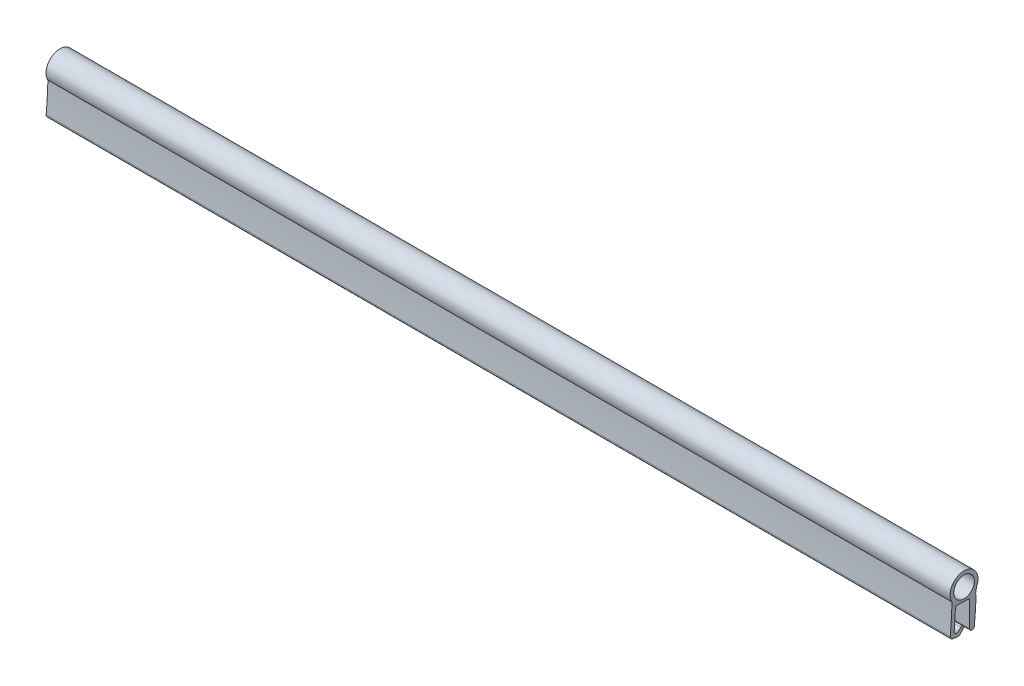
ISO-10303-21;
HEADER;
FILE_DESCRIPTION(('STEP AP214'),'2;1');
FILE_NAME('part.step','',(''),(''),'','','');
FILE_SCHEMA(('AUTOMOTIVE_DESIGN { 1 0 10303 214 1 1 1 1 }'));
ENDSEC;
DATA;
#1=APPLICATION_CONTEXT('core data for automotive mechanical design processes');
#2=APPLICATION_PROTOCOL_DEFINITION('international standard','automotive_design',2000,#1);
#3=PRODUCT_CONTEXT('',#1,'mechanical');
#4=PRODUCT('Part','Part','',(#3));
#5=PRODUCT_RELATED_PRODUCT_CATEGORY('part','',(#4));
#6=PRODUCT_DEFINITION_FORMATION('','',#4);
#7=PRODUCT_DEFINITION_CONTEXT('part definition',#1,'design');
#8=PRODUCT_DEFINITION('design','',#6,#7);
#9=PRODUCT_DEFINITION_SHAPE('','',#8);
#10=(LENGTH_UNIT() NAMED_UNIT(*) SI_UNIT(.MILLI.,.METRE.));
#11=(NAMED_UNIT(*) PLANE_ANGLE_UNIT() SI_UNIT($,.RADIAN.));
#12=(NAMED_UNIT(*) SI_UNIT($,.STERADIAN.) SOLID_ANGLE_UNIT());
#13=UNCERTAINTY_MEASURE_WITH_UNIT(LENGTH_MEASURE(1.E-05),#10,'distance_accuracy_value','');
#14=(GEOMETRIC_REPRESENTATION_CONTEXT(3) GLOBAL_UNCERTAINTY_ASSIGNED_CONTEXT((#13)) GLOBAL_UNIT_ASSIGNED_CONTEXT((#10,
#11,#12)) REPRESENTATION_CONTEXT('',''));
#15=CARTESIAN_POINT('',(0.,0.,0.));
#16=DIRECTION('',(0.,0.,1.));
#17=DIRECTION('',(1.,0.,0.));
#18=AXIS2_PLACEMENT_3D('',#15,#16,#17);
#19=CARTESIAN_POINT('',(149.,-0.650830109860595,2.03541757148668));
#20=DIRECTION('',(1.,0.,0.));
#21=DIRECTION('',(0.,0.,-1.));
#22=AXIS2_PLACEMENT_3D('',#19,#20,#21);
#23=PLANE('',#22);
#24=CARTESIAN_POINT('',(149.,-0.650830109860595,2.03541757148668));
#25=DIRECTION('',(1.,0.,0.));
#26=DIRECTION('',(0.,0.,-1.));
#27=AXIS2_PLACEMENT_3D('',#24,#25,#26);
#28=CIRCLE('',#27,2.30000000000009);
#29=CARTESIAN_POINT('',(149.,-1.75288906355364,0.0166392125314426));
#30=VERTEX_POINT('',#29);
#31=CARTESIAN_POINT('',(149.,-1.80815685312589,4.02302789781395));
#32=VERTEX_POINT('',#31);
#33=EDGE_CURVE('E248',#30,#32,#28,.T.);
#34=ORIENTED_EDGE('',*,*,#33,.T.);
#35=CARTESIAN_POINT('',(149.,0.,75.));
#36=DIRECTION('',(-1.,0.,0.));
#37=DIRECTION('',(0.,0.,-1.));
#38=AXIS2_PLACEMENT_3D('',#35,#36,#37);
#39=CIRCLE('',#38,71.);
#40=CARTESIAN_POINT('',(149.,-6.60581165375607,4.30796896116858));
#41=VERTEX_POINT('',#40);
#42=EDGE_CURVE('E131',#32,#41,#39,.T.);
#43=ORIENTED_EDGE('',*,*,#42,.T.);
#44=CARTESIAN_POINT('',(149.,-6.65233145413448,3.81013775666977));
#45=DIRECTION('',(1.,0.,0.));
#46=DIRECTION('',(0.,0.,-1.));
#47=AXIS2_PLACEMENT_3D('',#44,#45,#46);
#48=CIRCLE('',#47,0.500000000000065);
#49=CARTESIAN_POINT('',(149.,-7.14982517268786,3.86013775666976));
#50=VERTEX_POINT('',#49);
#51=EDGE_CURVE('E302',#41,#50,#48,.T.);
#52=ORIENTED_EDGE('',*,*,#51,.T.);
#53=DIRECTION('',(0.,-0.0999999999999999,-0.99498743710662));
#54=VECTOR('',#53,1.);
#55=CARTESIAN_POINT('',(149.,-7.14982517268794,3.86013775666977));
#56=LINE('',#55,#54);
#57=CARTESIAN_POINT('',(149.,-7.23653013578502,2.9974342665059));
#58=VERTEX_POINT('',#57);
#59=EDGE_CURVE('E321',#50,#58,#56,.T.);
#60=ORIENTED_EDGE('',*,*,#59,.T.);
#61=CARTESIAN_POINT('',(149.,-6.93803390465304,2.96743426650591));
#62=DIRECTION('',(1.,0.,0.));
#63=DIRECTION('',(0.,0.,1.));
#64=AXIS2_PLACEMENT_3D('',#61,#62,#63);
#65=CIRCLE('',#64,0.300000000000001);
#66=CARTESIAN_POINT('',(149.,-7.150165939009,2.75530223214994));
#67=VERTEX_POINT('',#66);
#68=EDGE_CURVE('E318',#58,#67,#65,.T.);
#69=ORIENTED_EDGE('',*,*,#68,.T.);
#70=DIRECTION('',(0.,0.707106781186551,-0.707106781186544));
#71=VECTOR('',#70,1.);
#72=CARTESIAN_POINT('',(149.,-6.56026190706562,2.16539820020656));
#73=LINE('',#72,#71);
#74=CARTESIAN_POINT('',(149.,-6.56026190706562,2.16539820020656));
#75=VERTEX_POINT('',#74);
#76=EDGE_CURVE('E320',#67,#75,#73,.T.);
#77=ORIENTED_EDGE('',*,*,#76,.T.);
#78=CARTESIAN_POINT('',(149.,-6.34812987270965,2.37753023456253));
#79=DIRECTION('',(1.,0.,0.));
#80=DIRECTION('',(0.,0.,-1.));
#81=AXIS2_PLACEMENT_3D('',#78,#79,#80);
#82=CIRCLE('',#81,0.3);
#83=CARTESIAN_POINT('',(149.,-6.13599783835369,2.58966226891849));
#84=VERTEX_POINT('',#83);
#85=EDGE_CURVE('E323',#75,#84,#82,.T.);
#86=ORIENTED_EDGE('',*,*,#85,.T.);
#87=DIRECTION('',(0.,-0.70710678118655,0.707106781186545));
#88=VECTOR('',#87,1.);
#89=CARTESIAN_POINT('',(149.,-6.13599783835369,2.58966226891849));
#90=LINE('',#89,#88);
#91=CARTESIAN_POINT('',(149.,-6.55825231483048,3.01191674539528));
#92=VERTEX_POINT('',#91);
#93=EDGE_CURVE('E329',#84,#92,#90,.T.);
#94=ORIENTED_EDGE('',*,*,#93,.T.);
#95=CARTESIAN_POINT('',(149.,-6.41683095859293,3.15333810163234));
#96=DIRECTION('',(-1.,0.,0.));
#97=DIRECTION('',(0.,0.,-1.));
#98=AXIS2_PLACEMENT_3D('',#95,#96,#97);
#99=CIRCLE('',#98,0.200000000000134);
#100=CARTESIAN_POINT('',(149.,-6.61582844601436,3.17333810163258));
#101=VERTEX_POINT('',#100);
#102=EDGE_CURVE('E331',#92,#101,#99,.T.);
#103=ORIENTED_EDGE('',*,*,#102,.T.);
#104=DIRECTION('',(0.,0.100000000000037,0.994987437106616));
#105=VECTOR('',#104,1.);
#106=CARTESIAN_POINT('',(149.,-6.59244423333353,3.40600808007444));
#107=LINE('',#106,#105);
#108=CARTESIAN_POINT('',(149.,-6.59244423333353,3.40600808007444));
#109=VERTEX_POINT('',#108);
#110=EDGE_CURVE('E333',#101,#109,#107,.T.);
#111=ORIENTED_EDGE('',*,*,#110,.T.);
#112=CARTESIAN_POINT('',(149.,-6.29394800220127,3.37600808007427));
#113=DIRECTION('',(-1.,0.,0.));
#114=DIRECTION('',(0.,0.,-1.));
#115=AXIS2_PLACEMENT_3D('',#112,#113,#114);
#116=CIRCLE('',#115,0.300000000000135);
#117=CARTESIAN_POINT('',(149.,-6.26768674489028,3.67485644691694));
#118=VERTEX_POINT('',#117);
#119=EDGE_CURVE('E335',#109,#118,#116,.T.);
#120=ORIENTED_EDGE('',*,*,#119,.T.);
#121=CARTESIAN_POINT('',(149.,0.,75.));
#122=DIRECTION('',(1.,0.,0.));
#123=DIRECTION('',(0.,0.,1.));
#124=AXIS2_PLACEMENT_3D('',#121,#122,#123);
#125=CIRCLE('',#124,71.6);
#126=CARTESIAN_POINT('',(149.,-2.97015351103039,3.46163135686617));
#127=VERTEX_POINT('',#126);
#128=EDGE_CURVE('E337',#118,#127,#125,.T.);
#129=ORIENTED_EDGE('',*,*,#128,.T.);
#130=CARTESIAN_POINT('',(149.,-2.98259828831126,3.16188958880835));
#131=DIRECTION('',(-1.,0.,0.));
#132=DIRECTION('',(0.,0.,1.));
#133=AXIS2_PLACEMENT_3D('',#130,#131,#132);
#134=CIRCLE('',#133,0.299999999999999);
#135=CARTESIAN_POINT('',(149.,-2.68277009359612,3.15173805425141));
#136=VERTEX_POINT('',#135);
#137=EDGE_CURVE('E339',#127,#136,#134,.T.);
#138=ORIENTED_EDGE('',*,*,#137,.T.);
#139=DIRECTION('',(0.,-0.0338384485231478,-0.999427315717129));
#140=VECTOR('',#139,1.);
#141=CARTESIAN_POINT('',(149.,-2.68277009359612,3.15173805425141));
#142=LINE('',#141,#140);
#143=CARTESIAN_POINT('',(149.,-2.74255173599329,1.38607180778347));
#144=VERTEX_POINT('',#143);
#145=EDGE_CURVE('E341',#136,#144,#142,.T.);
#146=ORIENTED_EDGE('',*,*,#145,.T.);
#147=CARTESIAN_POINT('',(149.,-3.04237993070843,1.39622334234042));
#148=DIRECTION('',(-1.,0.,0.));
#149=DIRECTION('',(0.,0.,1.));
#150=AXIS2_PLACEMENT_3D('',#147,#148,#149);
#151=CIRCLE('',#150,0.3);
#152=CARTESIAN_POINT('',(149.,-3.04237993070843,1.09622334234042));
#153=VERTEX_POINT('',#152);
#154=EDGE_CURVE('E343',#144,#153,#151,.T.);
#155=ORIENTED_EDGE('',*,*,#154,.T.);
#156=DIRECTION('',(0.,-1.,0.));
#157=VECTOR('',#156,1.);
#158=CARTESIAN_POINT('',(149.,-7.08425590173751,1.09622334234042));
#159=LINE('',#158,#157);
#160=CARTESIAN_POINT('',(149.,-7.08425590173751,1.09622334234042));
#161=VERTEX_POINT('',#160);
#162=EDGE_CURVE('E345',#153,#161,#159,.T.);
#163=ORIENTED_EDGE('',*,*,#162,.T.);
#164=CARTESIAN_POINT('',(149.,-7.08425590173751,0.716632184241867));
#165=DIRECTION('',(1.,0.,0.));
#166=DIRECTION('',(0.,0.,-1.));
#167=AXIS2_PLACEMENT_3D('',#164,#165,#166);
#168=CIRCLE('',#167,0.379591158098444);
#169=CARTESIAN_POINT('',(149.,-7.12029323982961,0.338755540917946));
#170=VERTEX_POINT('',#169);
#171=EDGE_CURVE('E347',#161,#170,#168,.T.);
#172=ORIENTED_EDGE('',*,*,#171,.T.);
#173=CARTESIAN_POINT('',(149.,0.,75.));
#174=DIRECTION('',(1.,0.,0.));
#175=DIRECTION('',(0.,0.,-1.));
#176=AXIS2_PLACEMENT_3D('',#173,#174,#175);
#177=CIRCLE('',#176,74.9999999999999);
#178=CARTESIAN_POINT('',(149.,-2.73749429668321,0.0499758173781173));
#179=VERTEX_POINT('',#178);
#180=EDGE_CURVE('E189',#170,#179,#177,.T.);
#181=ORIENTED_EDGE('',*,*,#180,.T.);
#182=DIRECTION('',(0.,0.730629228662196,0.682774435831106));
#183=VECTOR('',#182,1.);
#184=CARTESIAN_POINT('',(149.,-2.53111594953157,0.242836784358741));
#185=LINE('',#184,#183);
#186=CARTESIAN_POINT('',(149.,-2.53111594953157,0.242836784358741));
#187=VERTEX_POINT('',#186);
#188=EDGE_CURVE('E183',#179,#187,#185,.T.);
#189=ORIENTED_EDGE('',*,*,#188,.T.);
#190=DIRECTION('',(0.,0.68277443583108,-0.73062922866222));
#191=VECTOR('',#190,1.);
#192=CARTESIAN_POINT('',(149.,-2.3382549825508,0.036458437207107));
#193=LINE('',#192,#191);
#194=CARTESIAN_POINT('',(149.,-2.3382549825508,0.036458437207107));
#195=VERTEX_POINT('',#194);
#196=EDGE_CURVE('E187',#187,#195,#193,.T.);
#197=ORIENTED_EDGE('',*,*,#196,.T.);
#198=DIRECTION('',(0.,0.999427315717129,-0.0338384485231536));
#199=VECTOR('',#198,1.);
#200=CARTESIAN_POINT('',(149.,-2.3382549825508,0.036458437207107));
#201=LINE('',#200,#199);
#202=EDGE_CURVE('E49',#195,#30,#201,.T.);
#203=ORIENTED_EDGE('',*,*,#202,.T.);
#204=EDGE_LOOP('',(#34,#43,#52,#60,#69,#77,#86,#94,#103,#111,#120,#129,#138,#146,#155,#163,#172,
#181,#189,#197,#203));
#205=FACE_BOUND('',#204,.T.);
#206=CARTESIAN_POINT('',(149.,-0.650830109860595,2.03541757148668));
#207=DIRECTION('',(1.,0.,0.));
#208=DIRECTION('',(0.,0.,-1.));
#209=AXIS2_PLACEMENT_3D('',#206,#207,#208);
#210=CIRCLE('',#209,1.70000000000194);
#211=CARTESIAN_POINT('',(149.,-0.650830109860595,0.335417571484737));
#212=VERTEX_POINT('',#211);
#213=EDGE_CURVE('E211',#212,#212,#210,.T.);
#214=ORIENTED_EDGE('',*,*,#213,.F.);
#215=EDGE_LOOP('',(#214));
#216=FACE_BOUND('',#215,.T.);
#217=ADVANCED_FACE('F32',(#205,#216),#23,.T.);
#218=CARTESIAN_POINT('',(0.,-0.650830109860595,2.03541757148668));
#219=DIRECTION('',(1.,0.,0.));
#220=DIRECTION('',(0.,0.,-1.));
#221=AXIS2_PLACEMENT_3D('',#218,#219,#220);
#222=PLANE('',#221);
#223=CARTESIAN_POINT('',(0.,-0.650830109860595,2.03541757148668));
#224=DIRECTION('',(1.,0.,0.));
#225=DIRECTION('',(0.,0.,-1.));
#226=AXIS2_PLACEMENT_3D('',#223,#224,#225);
#227=CIRCLE('',#226,2.30000000000009);
#228=CARTESIAN_POINT('',(0.,-1.75288906355364,0.0166392125314426));
#229=VERTEX_POINT('',#228);
#230=CARTESIAN_POINT('',(0.,-1.80815685312589,4.02302789781395));
#231=VERTEX_POINT('',#230);
#232=EDGE_CURVE('E207',#229,#231,#227,.T.);
#233=ORIENTED_EDGE('',*,*,#232,.F.);
#234=DIRECTION('',(0.,0.999427315717129,-0.0338384485231536));
#235=VECTOR('',#234,1.);
#236=CARTESIAN_POINT('',(0.,-2.3382549825508,0.036458437207107));
#237=LINE('',#236,#235);
#238=CARTESIAN_POINT('',(0.,-2.3382549825508,0.036458437207107));
#239=VERTEX_POINT('',#238);
#240=EDGE_CURVE('E123',#239,#229,#237,.T.);
#241=ORIENTED_EDGE('',*,*,#240,.F.);
#242=DIRECTION('',(0.,0.68277443583108,-0.73062922866222));
#243=VECTOR('',#242,1.);
#244=CARTESIAN_POINT('',(0.,-2.3382549825508,0.036458437207107));
#245=LINE('',#244,#243);
#246=CARTESIAN_POINT('',(0.,-2.53111594953157,0.242836784358741));
#247=VERTEX_POINT('',#246);
#248=EDGE_CURVE('E117',#247,#239,#245,.T.);
#249=ORIENTED_EDGE('',*,*,#248,.F.);
#250=DIRECTION('',(0.,0.730629228662196,0.682774435831106));
#251=VECTOR('',#250,1.);
#252=CARTESIAN_POINT('',(0.,-2.53111594953157,0.242836784358741));
#253=LINE('',#252,#251);
#254=CARTESIAN_POINT('',(0.,-2.73749429668321,0.0499758173781173));
#255=VERTEX_POINT('',#254);
#256=EDGE_CURVE('E197',#255,#247,#253,.T.);
#257=ORIENTED_EDGE('',*,*,#256,.F.);
#258=CARTESIAN_POINT('',(0.,0.,75.));
#259=DIRECTION('',(1.,0.,0.));
#260=DIRECTION('',(0.,0.,-1.));
#261=AXIS2_PLACEMENT_3D('',#258,#259,#260);
#262=CIRCLE('',#261,74.9999999999999);
#263=CARTESIAN_POINT('',(0.,-7.12029323982961,0.338755540917946));
#264=VERTEX_POINT('',#263);
#265=EDGE_CURVE('E243',#264,#255,#262,.T.);
#266=ORIENTED_EDGE('',*,*,#265,.F.);
#267=CARTESIAN_POINT('',(0.,-7.08425590173751,0.716632184241867));
#268=DIRECTION('',(1.,0.,0.));
#269=DIRECTION('',(0.,0.,-1.));
#270=AXIS2_PLACEMENT_3D('',#267,#268,#269);
#271=CIRCLE('',#270,0.379591158098444);
#272=CARTESIAN_POINT('',(0.,-7.08425590173751,1.09622334234042));
#273=VERTEX_POINT('',#272);
#274=EDGE_CURVE('E241',#273,#264,#271,.T.);
#275=ORIENTED_EDGE('',*,*,#274,.F.);
#276=DIRECTION('',(0.,-1.,0.));
#277=VECTOR('',#276,1.);
#278=CARTESIAN_POINT('',(0.,-7.08425590173751,1.09622334234042));
#279=LINE('',#278,#277);
#280=CARTESIAN_POINT('',(0.,-3.04237993070843,1.09622334234042));
#281=VERTEX_POINT('',#280);
#282=EDGE_CURVE('E239',#281,#273,#279,.T.);
#283=ORIENTED_EDGE('',*,*,#282,.F.);
#284=CARTESIAN_POINT('',(0.,-3.04237993070843,1.39622334234042));
#285=DIRECTION('',(-1.,0.,0.));
#286=DIRECTION('',(0.,0.,1.));
#287=AXIS2_PLACEMENT_3D('',#284,#285,#286);
#288=CIRCLE('',#287,0.3);
#289=CARTESIAN_POINT('',(0.,-2.74255173599329,1.38607180778347));
#290=VERTEX_POINT('',#289);
#291=EDGE_CURVE('E237',#290,#281,#288,.T.);
#292=ORIENTED_EDGE('',*,*,#291,.F.);
#293=DIRECTION('',(0.,-0.0338384485231478,-0.999427315717129));
#294=VECTOR('',#293,1.);
#295=CARTESIAN_POINT('',(0.,-2.68277009359612,3.15173805425141));
#296=LINE('',#295,#294);
#297=CARTESIAN_POINT('',(0.,-2.68277009359612,3.15173805425141));
#298=VERTEX_POINT('',#297);
#299=EDGE_CURVE('E235',#298,#290,#296,.T.);
#300=ORIENTED_EDGE('',*,*,#299,.F.);
#301=CARTESIAN_POINT('',(0.,-2.98259828831126,3.16188958880835));
#302=DIRECTION('',(-1.,0.,0.));
#303=DIRECTION('',(0.,0.,1.));
#304=AXIS2_PLACEMENT_3D('',#301,#302,#303);
#305=CIRCLE('',#304,0.299999999999999);
#306=CARTESIAN_POINT('',(0.,-2.97015351103039,3.46163135686617));
#307=VERTEX_POINT('',#306);
#308=EDGE_CURVE('E233',#307,#298,#305,.T.);
#309=ORIENTED_EDGE('',*,*,#308,.F.);
#310=CARTESIAN_POINT('',(0.,0.,75.));
#311=DIRECTION('',(1.,0.,0.));
#312=DIRECTION('',(0.,0.,1.));
#313=AXIS2_PLACEMENT_3D('',#310,#311,#312);
#314=CIRCLE('',#313,71.6);
#315=CARTESIAN_POINT('',(0.,-6.26768674489028,3.67485644691694));
#316=VERTEX_POINT('',#315);
#317=EDGE_CURVE('E231',#316,#307,#314,.T.);
#318=ORIENTED_EDGE('',*,*,#317,.F.);
#319=CARTESIAN_POINT('',(0.,-6.29394800220127,3.37600808007427));
#320=DIRECTION('',(-1.,0.,0.));
#321=DIRECTION('',(0.,0.,-1.));
#322=AXIS2_PLACEMENT_3D('',#319,#320,#321);
#323=CIRCLE('',#322,0.300000000000135);
#324=CARTESIAN_POINT('',(0.,-6.59244423333353,3.40600808007444));
#325=VERTEX_POINT('',#324);
#326=EDGE_CURVE('E229',#325,#316,#323,.T.);
#327=ORIENTED_EDGE('',*,*,#326,.F.);
#328=DIRECTION('',(0.,0.100000000000037,0.994987437106616));
#329=VECTOR('',#328,1.);
#330=CARTESIAN_POINT('',(0.,-6.59244423333353,3.40600808007444));
#331=LINE('',#330,#329);
#332=CARTESIAN_POINT('',(0.,-6.61582844601436,3.17333810163258));
#333=VERTEX_POINT('',#332);
#334=EDGE_CURVE('E227',#333,#325,#331,.T.);
#335=ORIENTED_EDGE('',*,*,#334,.F.);
#336=CARTESIAN_POINT('',(0.,-6.41683095859293,3.15333810163234));
#337=DIRECTION('',(-1.,0.,0.));
#338=DIRECTION('',(0.,0.,-1.));
#339=AXIS2_PLACEMENT_3D('',#336,#337,#338);
#340=CIRCLE('',#339,0.200000000000134);
#341=CARTESIAN_POINT('',(0.,-6.55825231483048,3.01191674539528));
#342=VERTEX_POINT('',#341);
#343=EDGE_CURVE('E225',#342,#333,#340,.T.);
#344=ORIENTED_EDGE('',*,*,#343,.F.);
#345=DIRECTION('',(0.,-0.70710678118655,0.707106781186545));
#346=VECTOR('',#345,1.);
#347=CARTESIAN_POINT('',(0.,-6.13599783835369,2.58966226891849));
#348=LINE('',#347,#346);
#349=CARTESIAN_POINT('',(0.,-6.13599783835369,2.58966226891849));
#350=VERTEX_POINT('',#349);
#351=EDGE_CURVE('E223',#350,#342,#348,.T.);
#352=ORIENTED_EDGE('',*,*,#351,.F.);
#353=CARTESIAN_POINT('',(0.,-6.34812987270965,2.37753023456253));
#354=DIRECTION('',(1.,0.,0.));
#355=DIRECTION('',(0.,0.,-1.));
#356=AXIS2_PLACEMENT_3D('',#353,#354,#355);
#357=CIRCLE('',#356,0.3);
#358=CARTESIAN_POINT('',(0.,-6.56026190706562,2.16539820020656));
#359=VERTEX_POINT('',#358);
#360=EDGE_CURVE('E221',#359,#350,#357,.T.);
#361=ORIENTED_EDGE('',*,*,#360,.F.);
#362=DIRECTION('',(0.,0.707106781186551,-0.707106781186544));
#363=VECTOR('',#362,1.);
#364=CARTESIAN_POINT('',(0.,-6.56026190706562,2.16539820020656));
#365=LINE('',#364,#363);
#366=CARTESIAN_POINT('',(0.,-7.150165939009,2.75530223214994));
#367=VERTEX_POINT('',#366);
#368=EDGE_CURVE('E219',#367,#359,#365,.T.);
#369=ORIENTED_EDGE('',*,*,#368,.F.);
#370=CARTESIAN_POINT('',(0.,-6.93803390465304,2.96743426650591));
#371=DIRECTION('',(1.,0.,0.));
#372=DIRECTION('',(0.,0.,1.));
#373=AXIS2_PLACEMENT_3D('',#370,#371,#372);
#374=CIRCLE('',#373,0.300000000000001);
#375=CARTESIAN_POINT('',(0.,-7.23653013578502,2.9974342665059));
#376=VERTEX_POINT('',#375);
#377=EDGE_CURVE('E217',#376,#367,#374,.T.);
#378=ORIENTED_EDGE('',*,*,#377,.F.);
#379=DIRECTION('',(0.,-0.0999999999999999,-0.99498743710662));
#380=VECTOR('',#379,1.);
#381=CARTESIAN_POINT('',(0.,-7.14982517268794,3.86013775666977));
#382=LINE('',#381,#380);
#383=CARTESIAN_POINT('',(0.,-7.14982517268786,3.86013775666976));
#384=VERTEX_POINT('',#383);
#385=EDGE_CURVE('E215',#384,#376,#382,.T.);
#386=ORIENTED_EDGE('',*,*,#385,.F.);
#387=CARTESIAN_POINT('',(0.,-6.65233145413448,3.81013775666977));
#388=DIRECTION('',(1.,0.,0.));
#389=DIRECTION('',(0.,0.,-1.));
#390=AXIS2_PLACEMENT_3D('',#387,#388,#389);
#391=CIRCLE('',#390,0.500000000000065);
#392=CARTESIAN_POINT('',(0.,-6.60581165375607,4.30796896116858));
#393=VERTEX_POINT('',#392);
#394=EDGE_CURVE('E213',#393,#384,#391,.T.);
#395=ORIENTED_EDGE('',*,*,#394,.F.);
#396=CARTESIAN_POINT('',(0.,0.,75.));
#397=DIRECTION('',(-1.,0.,0.));
#398=DIRECTION('',(0.,0.,-1.));
#399=AXIS2_PLACEMENT_3D('',#396,#397,#398);
#400=CIRCLE('',#399,71.);
#401=EDGE_CURVE('E210',#231,#393,#400,.T.);
#402=ORIENTED_EDGE('',*,*,#401,.F.);
#403=EDGE_LOOP('',(#233,#241,#249,#257,#266,#275,#283,#292,#300,#309,#318,#327,#335,#344,#352,
#361,#369,#378,#386,#395,#402));
#404=FACE_BOUND('',#403,.T.);
#405=CARTESIAN_POINT('',(0.,-0.650830109860595,2.03541757148668));
#406=DIRECTION('',(1.,0.,0.));
#407=DIRECTION('',(0.,0.,-1.));
#408=AXIS2_PLACEMENT_3D('',#405,#406,#407);
#409=CIRCLE('',#408,1.70000000000194);
#410=CARTESIAN_POINT('',(0.,-0.650830109860595,0.335417571484737));
#411=VERTEX_POINT('',#410);
#412=EDGE_CURVE('E611',#411,#411,#409,.T.);
#413=ORIENTED_EDGE('',*,*,#412,.T.);
#414=EDGE_LOOP('',(#413));
#415=FACE_BOUND('',#414,.T.);
#416=ADVANCED_FACE('F306',(#404,#415),#222,.F.);
#417=CARTESIAN_POINT('',(149.,-0.650830109860595,2.03541757148668));
#418=DIRECTION('',(-1.,0.,0.));
#419=DIRECTION('',(0.,0.,1.));
#420=AXIS2_PLACEMENT_3D('',#417,#418,#419);
#421=CYLINDRICAL_SURFACE('',#420,2.30000000000009);
#422=ORIENTED_EDGE('',*,*,#232,.T.);
#423=DIRECTION('',(-1.,0.,0.));
#424=VECTOR('',#423,1.);
#425=CARTESIAN_POINT('',(149.,-1.80815685312589,4.02302789781395));
#426=LINE('',#425,#424);
#427=EDGE_CURVE('E11',#32,#231,#426,.T.);
#428=ORIENTED_EDGE('',*,*,#427,.F.);
#429=ORIENTED_EDGE('',*,*,#33,.F.);
#430=DIRECTION('',(-1.,0.,0.));
#431=VECTOR('',#430,1.);
#432=CARTESIAN_POINT('',(149.,-1.75288906355364,0.0166392125314426));
#433=LINE('',#432,#431);
#434=EDGE_CURVE('E203',#30,#229,#433,.T.);
#435=ORIENTED_EDGE('',*,*,#434,.T.);
#436=EDGE_LOOP('',(#422,#428,#429,#435));
#437=FACE_BOUND('',#436,.T.);
#438=ADVANCED_FACE('F34',(#437),#421,.T.);
#439=CARTESIAN_POINT('',(149.,0.,75.));
#440=DIRECTION('',(-1.,0.,0.));
#441=DIRECTION('',(0.,0.,1.));
#442=AXIS2_PLACEMENT_3D('',#439,#440,#441);
#443=CYLINDRICAL_SURFACE('',#442,71.);
#444=ORIENTED_EDGE('',*,*,#401,.T.);
#445=DIRECTION('',(-1.,0.,0.));
#446=VECTOR('',#445,1.);
#447=CARTESIAN_POINT('',(149.,-6.60581165375607,4.30796896116858));
#448=LINE('',#447,#446);
#449=EDGE_CURVE('E41',#41,#393,#448,.T.);
#450=ORIENTED_EDGE('',*,*,#449,.F.);
#451=ORIENTED_EDGE('',*,*,#42,.F.);
#452=ORIENTED_EDGE('',*,*,#427,.T.);
#453=EDGE_LOOP('',(#444,#450,#451,#452));
#454=FACE_BOUND('',#453,.T.);
#455=ADVANCED_FACE('F381',(#454),#443,.F.);
#456=CARTESIAN_POINT('',(149.,-6.65233145413448,3.81013775666977));
#457=DIRECTION('',(-1.,0.,0.));
#458=DIRECTION('',(0.,0.,1.));
#459=AXIS2_PLACEMENT_3D('',#456,#457,#458);
#460=CYLINDRICAL_SURFACE('',#459,0.500000000000065);
#461=ORIENTED_EDGE('',*,*,#394,.T.);
#462=DIRECTION('',(-1.,0.,0.));
#463=VECTOR('',#462,1.);
#464=CARTESIAN_POINT('',(149.,-7.14982517268786,3.86013775666976));
#465=LINE('',#464,#463);
#466=EDGE_CURVE('E294',#50,#384,#465,.T.);
#467=ORIENTED_EDGE('',*,*,#466,.F.);
#468=ORIENTED_EDGE('',*,*,#51,.F.);
#469=ORIENTED_EDGE('',*,*,#449,.T.);
#470=EDGE_LOOP('',(#461,#467,#468,#469));
#471=FACE_BOUND('',#470,.T.);
#472=ADVANCED_FACE('F300',(#471),#460,.T.);
#473=CARTESIAN_POINT('',(149.,-7.14982517268794,3.86013775666977));
#474=DIRECTION('',(0.,0.99498743710662,-0.0999999999999999));
#475=DIRECTION('',(0.,0.0999999999999999,0.99498743710662));
#476=AXIS2_PLACEMENT_3D('',#473,#474,#475);
#477=PLANE('',#476);
#478=ORIENTED_EDGE('',*,*,#385,.T.);
#479=DIRECTION('',(-1.,0.,0.));
#480=VECTOR('',#479,1.);
#481=CARTESIAN_POINT('',(149.,-7.23653013578502,2.9974342665059));
#482=LINE('',#481,#480);
#483=EDGE_CURVE('E291',#58,#376,#482,.T.);
#484=ORIENTED_EDGE('',*,*,#483,.F.);
#485=ORIENTED_EDGE('',*,*,#59,.F.);
#486=ORIENTED_EDGE('',*,*,#466,.T.);
#487=EDGE_LOOP('',(#478,#484,#485,#486));
#488=FACE_BOUND('',#487,.T.);
#489=ADVANCED_FACE('F312',(#488),#477,.F.);
#490=CARTESIAN_POINT('',(149.,-6.93803390465304,2.96743426650591));
#491=DIRECTION('',(-1.,0.,0.));
#492=DIRECTION('',(0.,0.,1.));
#493=AXIS2_PLACEMENT_3D('',#490,#491,#492);
#494=CYLINDRICAL_SURFACE('',#493,0.300000000000001);
#495=ORIENTED_EDGE('',*,*,#377,.T.);
#496=DIRECTION('',(-1.,0.,0.));
#497=VECTOR('',#496,1.);
#498=CARTESIAN_POINT('',(149.,-7.150165939009,2.75530223214994));
#499=LINE('',#498,#497);
#500=EDGE_CURVE('E288',#67,#367,#499,.T.);
#501=ORIENTED_EDGE('',*,*,#500,.F.);
#502=ORIENTED_EDGE('',*,*,#68,.F.);
#503=ORIENTED_EDGE('',*,*,#483,.T.);
#504=EDGE_LOOP('',(#495,#501,#502,#503));
#505=FACE_BOUND('',#504,.T.);
#506=ADVANCED_FACE('F316',(#505),#494,.T.);
#507=CARTESIAN_POINT('',(149.,-6.56026190706562,2.16539820020656));
#508=DIRECTION('',(0.,0.707106781186544,0.707106781186551));
#509=DIRECTION('',(0.,-0.707106781186551,0.707106781186544));
#510=AXIS2_PLACEMENT_3D('',#507,#508,#509);
#511=PLANE('',#510);
#512=ORIENTED_EDGE('',*,*,#368,.T.);
#513=DIRECTION('',(-1.,0.,0.));
#514=VECTOR('',#513,1.);
#515=CARTESIAN_POINT('',(149.,-6.56026190706562,2.16539820020656));
#516=LINE('',#515,#514);
#517=EDGE_CURVE('E285',#75,#359,#516,.T.);
#518=ORIENTED_EDGE('',*,*,#517,.F.);
#519=ORIENTED_EDGE('',*,*,#76,.F.);
#520=ORIENTED_EDGE('',*,*,#500,.T.);
#521=EDGE_LOOP('',(#512,#518,#519,#520));
#522=FACE_BOUND('',#521,.T.);
#523=ADVANCED_FACE('F394',(#522),#511,.F.);
#524=CARTESIAN_POINT('',(149.,-6.34812987270965,2.37753023456253));
#525=DIRECTION('',(-1.,0.,0.));
#526=DIRECTION('',(0.,0.,1.));
#527=AXIS2_PLACEMENT_3D('',#524,#525,#526);
#528=CYLINDRICAL_SURFACE('',#527,0.3);
#529=ORIENTED_EDGE('',*,*,#360,.T.);
#530=DIRECTION('',(-1.,0.,0.));
#531=VECTOR('',#530,1.);
#532=CARTESIAN_POINT('',(149.,-6.13599783835369,2.58966226891849));
#533=LINE('',#532,#531);
#534=EDGE_CURVE('E282',#84,#350,#533,.T.);
#535=ORIENTED_EDGE('',*,*,#534,.F.);
#536=ORIENTED_EDGE('',*,*,#85,.F.);
#537=ORIENTED_EDGE('',*,*,#517,.T.);
#538=EDGE_LOOP('',(#529,#535,#536,#537));
#539=FACE_BOUND('',#538,.T.);
#540=ADVANCED_FACE('F397',(#539),#528,.T.);
#541=CARTESIAN_POINT('',(149.,-6.13599783835369,2.58966226891849));
#542=DIRECTION('',(0.,-0.707106781186545,-0.70710678118655));
#543=DIRECTION('',(0.,0.70710678118655,-0.707106781186545));
#544=AXIS2_PLACEMENT_3D('',#541,#542,#543);
#545=PLANE('',#544);
#546=ORIENTED_EDGE('',*,*,#351,.T.);
#547=DIRECTION('',(-1.,0.,0.));
#548=VECTOR('',#547,1.);
#549=CARTESIAN_POINT('',(149.,-6.55825231483048,3.01191674539528));
#550=LINE('',#549,#548);
#551=EDGE_CURVE('E279',#92,#342,#550,.T.);
#552=ORIENTED_EDGE('',*,*,#551,.F.);
#553=ORIENTED_EDGE('',*,*,#93,.F.);
#554=ORIENTED_EDGE('',*,*,#534,.T.);
#555=EDGE_LOOP('',(#546,#552,#553,#554));
#556=FACE_BOUND('',#555,.T.);
#557=ADVANCED_FACE('F401',(#556),#545,.F.);
#558=CARTESIAN_POINT('',(149.,-6.41683095859293,3.15333810163234));
#559=DIRECTION('',(-1.,0.,0.));
#560=DIRECTION('',(0.,0.,1.));
#561=AXIS2_PLACEMENT_3D('',#558,#559,#560);
#562=CYLINDRICAL_SURFACE('',#561,0.200000000000134);
#563=ORIENTED_EDGE('',*,*,#343,.T.);
#564=DIRECTION('',(-1.,0.,0.));
#565=VECTOR('',#564,1.);
#566=CARTESIAN_POINT('',(149.,-6.61582844601436,3.17333810163258));
#567=LINE('',#566,#565);
#568=EDGE_CURVE('E276',#101,#333,#567,.T.);
#569=ORIENTED_EDGE('',*,*,#568,.F.);
#570=ORIENTED_EDGE('',*,*,#102,.F.);
#571=ORIENTED_EDGE('',*,*,#551,.T.);
#572=EDGE_LOOP('',(#563,#569,#570,#571));
#573=FACE_BOUND('',#572,.T.);
#574=ADVANCED_FACE('F405',(#573),#562,.F.);
#575=CARTESIAN_POINT('',(149.,-6.59244423333353,3.40600808007444));
#576=DIRECTION('',(0.,-0.994987437106616,0.100000000000037));
#577=DIRECTION('',(0.,-0.100000000000037,-0.994987437106616));
#578=AXIS2_PLACEMENT_3D('',#575,#576,#577);
#579=PLANE('',#578);
#580=ORIENTED_EDGE('',*,*,#334,.T.);
#581=DIRECTION('',(-1.,0.,0.));
#582=VECTOR('',#581,1.);
#583=CARTESIAN_POINT('',(149.,-6.59244423333353,3.40600808007444));
#584=LINE('',#583,#582);
#585=EDGE_CURVE('E273',#109,#325,#584,.T.);
#586=ORIENTED_EDGE('',*,*,#585,.F.);
#587=ORIENTED_EDGE('',*,*,#110,.F.);
#588=ORIENTED_EDGE('',*,*,#568,.T.);
#589=EDGE_LOOP('',(#580,#586,#587,#588));
#590=FACE_BOUND('',#589,.T.);
#591=ADVANCED_FACE('F409',(#590),#579,.F.);
#592=CARTESIAN_POINT('',(149.,-6.29394800220127,3.37600808007427));
#593=DIRECTION('',(-1.,0.,0.));
#594=DIRECTION('',(0.,0.,1.));
#595=AXIS2_PLACEMENT_3D('',#592,#593,#594);
#596=CYLINDRICAL_SURFACE('',#595,0.300000000000135);
#597=ORIENTED_EDGE('',*,*,#326,.T.);
#598=DIRECTION('',(-1.,0.,0.));
#599=VECTOR('',#598,1.);
#600=CARTESIAN_POINT('',(149.,-6.26768674489028,3.67485644691694));
#601=LINE('',#600,#599);
#602=EDGE_CURVE('E270',#118,#316,#601,.T.);
#603=ORIENTED_EDGE('',*,*,#602,.F.);
#604=ORIENTED_EDGE('',*,*,#119,.F.);
#605=ORIENTED_EDGE('',*,*,#585,.T.);
#606=EDGE_LOOP('',(#597,#603,#604,#605));
#607=FACE_BOUND('',#606,.T.);
#608=ADVANCED_FACE('F413',(#607),#596,.F.);
#609=CARTESIAN_POINT('',(149.,0.,75.));
#610=DIRECTION('',(-1.,0.,0.));
#611=DIRECTION('',(0.,0.,1.));
#612=AXIS2_PLACEMENT_3D('',#609,#610,#611);
#613=CYLINDRICAL_SURFACE('',#612,71.6);
#614=ORIENTED_EDGE('',*,*,#317,.T.);
#615=DIRECTION('',(-1.,0.,0.));
#616=VECTOR('',#615,1.);
#617=CARTESIAN_POINT('',(149.,-2.97015351103039,3.46163135686617));
#618=LINE('',#617,#616);
#619=EDGE_CURVE('E267',#127,#307,#618,.T.);
#620=ORIENTED_EDGE('',*,*,#619,.F.);
#621=ORIENTED_EDGE('',*,*,#128,.F.);
#622=ORIENTED_EDGE('',*,*,#602,.T.);
#623=EDGE_LOOP('',(#614,#620,#621,#622));
#624=FACE_BOUND('',#623,.T.);
#625=ADVANCED_FACE('F417',(#624),#613,.T.);
#626=CARTESIAN_POINT('',(149.,-2.98259828831126,3.16188958880835));
#627=DIRECTION('',(-1.,0.,0.));
#628=DIRECTION('',(0.,0.,1.));
#629=AXIS2_PLACEMENT_3D('',#626,#627,#628);
#630=CYLINDRICAL_SURFACE('',#629,0.299999999999999);
#631=ORIENTED_EDGE('',*,*,#308,.T.);
#632=DIRECTION('',(-1.,0.,0.));
#633=VECTOR('',#632,1.);
#634=CARTESIAN_POINT('',(149.,-2.68277009359612,3.15173805425141));
#635=LINE('',#634,#633);
#636=EDGE_CURVE('E264',#136,#298,#635,.T.);
#637=ORIENTED_EDGE('',*,*,#636,.F.);
#638=ORIENTED_EDGE('',*,*,#137,.F.);
#639=ORIENTED_EDGE('',*,*,#619,.T.);
#640=EDGE_LOOP('',(#631,#637,#638,#639));
#641=FACE_BOUND('',#640,.T.);
#642=ADVANCED_FACE('F421',(#641),#630,.F.);
#643=CARTESIAN_POINT('',(149.,-2.68277009359612,3.15173805425141));
#644=DIRECTION('',(0.,0.999427315717129,-0.0338384485231478));
#645=DIRECTION('',(0.,0.0338384485231478,0.999427315717129));
#646=AXIS2_PLACEMENT_3D('',#643,#644,#645);
#647=PLANE('',#646);
#648=ORIENTED_EDGE('',*,*,#299,.T.);
#649=DIRECTION('',(-1.,0.,0.));
#650=VECTOR('',#649,1.);
#651=CARTESIAN_POINT('',(149.,-2.74255173599329,1.38607180778347));
#652=LINE('',#651,#650);
#653=EDGE_CURVE('E261',#144,#290,#652,.T.);
#654=ORIENTED_EDGE('',*,*,#653,.F.);
#655=ORIENTED_EDGE('',*,*,#145,.F.);
#656=ORIENTED_EDGE('',*,*,#636,.T.);
#657=EDGE_LOOP('',(#648,#654,#655,#656));
#658=FACE_BOUND('',#657,.T.);
#659=ADVANCED_FACE('F425',(#658),#647,.F.);
#660=CARTESIAN_POINT('',(149.,-3.04237993070843,1.39622334234042));
#661=DIRECTION('',(-1.,0.,0.));
#662=DIRECTION('',(0.,0.,1.));
#663=AXIS2_PLACEMENT_3D('',#660,#661,#662);
#664=CYLINDRICAL_SURFACE('',#663,0.3);
#665=ORIENTED_EDGE('',*,*,#291,.T.);
#666=DIRECTION('',(-1.,0.,0.));
#667=VECTOR('',#666,1.);
#668=CARTESIAN_POINT('',(149.,-3.04237993070843,1.09622334234042));
#669=LINE('',#668,#667);
#670=EDGE_CURVE('E258',#153,#281,#669,.T.);
#671=ORIENTED_EDGE('',*,*,#670,.F.);
#672=ORIENTED_EDGE('',*,*,#154,.F.);
#673=ORIENTED_EDGE('',*,*,#653,.T.);
#674=EDGE_LOOP('',(#665,#671,#672,#673));
#675=FACE_BOUND('',#674,.T.);
#676=ADVANCED_FACE('F429',(#675),#664,.F.);
#677=CARTESIAN_POINT('',(149.,-7.08425590173751,1.09622334234042));
#678=DIRECTION('',(0.,0.,-1.));
#679=DIRECTION('',(0.,1.,0.));
#680=AXIS2_PLACEMENT_3D('',#677,#678,#679);
#681=PLANE('',#680);
#682=ORIENTED_EDGE('',*,*,#282,.T.);
#683=DIRECTION('',(-1.,0.,0.));
#684=VECTOR('',#683,1.);
#685=CARTESIAN_POINT('',(149.,-7.08425590173751,1.09622334234042));
#686=LINE('',#685,#684);
#687=EDGE_CURVE('E255',#161,#273,#686,.T.);
#688=ORIENTED_EDGE('',*,*,#687,.F.);
#689=ORIENTED_EDGE('',*,*,#162,.F.);
#690=ORIENTED_EDGE('',*,*,#670,.T.);
#691=EDGE_LOOP('',(#682,#688,#689,#690));
#692=FACE_BOUND('',#691,.T.);
#693=ADVANCED_FACE('F433',(#692),#681,.F.);
#694=CARTESIAN_POINT('',(149.,-7.08425590173751,0.716632184241867));
#695=DIRECTION('',(-1.,0.,0.));
#696=DIRECTION('',(0.,0.,1.));
#697=AXIS2_PLACEMENT_3D('',#694,#695,#696);
#698=CYLINDRICAL_SURFACE('',#697,0.379591158098444);
#699=ORIENTED_EDGE('',*,*,#274,.T.);
#700=DIRECTION('',(-1.,0.,0.));
#701=VECTOR('',#700,1.);
#702=CARTESIAN_POINT('',(149.,-7.12029323982961,0.338755540917946));
#703=LINE('',#702,#701);
#704=EDGE_CURVE('E252',#170,#264,#703,.T.);
#705=ORIENTED_EDGE('',*,*,#704,.F.);
#706=ORIENTED_EDGE('',*,*,#171,.F.);
#707=ORIENTED_EDGE('',*,*,#687,.T.);
#708=EDGE_LOOP('',(#699,#705,#706,#707));
#709=FACE_BOUND('',#708,.T.);
#710=ADVANCED_FACE('F353',(#709),#698,.T.);
#711=CARTESIAN_POINT('',(149.,0.,75.));
#712=DIRECTION('',(-1.,0.,0.));
#713=DIRECTION('',(0.,0.,1.));
#714=AXIS2_PLACEMENT_3D('',#711,#712,#713);
#715=CYLINDRICAL_SURFACE('',#714,74.9999999999999);
#716=ORIENTED_EDGE('',*,*,#265,.T.);
#717=DIRECTION('',(-1.,0.,0.));
#718=VECTOR('',#717,1.);
#719=CARTESIAN_POINT('',(149.,-2.73749429668321,0.0499758173781173));
#720=LINE('',#719,#718);
#721=EDGE_CURVE('E198',#179,#255,#720,.T.);
#722=ORIENTED_EDGE('',*,*,#721,.F.);
#723=ORIENTED_EDGE('',*,*,#180,.F.);
#724=ORIENTED_EDGE('',*,*,#704,.T.);
#725=EDGE_LOOP('',(#716,#722,#723,#724));
#726=FACE_BOUND('',#725,.T.);
#727=ADVANCED_FACE('F357',(#726),#715,.T.);
#728=CARTESIAN_POINT('',(149.,-2.53111594953157,0.242836784358741));
#729=DIRECTION('',(0.,-0.682774435831106,0.730629228662196));
#730=DIRECTION('',(0.,-0.730629228662196,-0.682774435831106));
#731=AXIS2_PLACEMENT_3D('',#728,#729,#730);
#732=PLANE('',#731);
#733=ORIENTED_EDGE('',*,*,#256,.T.);
#734=DIRECTION('',(-1.,0.,0.));
#735=VECTOR('',#734,1.);
#736=CARTESIAN_POINT('',(149.,-2.53111594953157,0.242836784358741));
#737=LINE('',#736,#735);
#738=EDGE_CURVE('E194',#187,#247,#737,.T.);
#739=ORIENTED_EDGE('',*,*,#738,.F.);
#740=ORIENTED_EDGE('',*,*,#188,.F.);
#741=ORIENTED_EDGE('',*,*,#721,.T.);
#742=EDGE_LOOP('',(#733,#739,#740,#741));
#743=FACE_BOUND('',#742,.T.);
#744=ADVANCED_FACE('F195',(#743),#732,.F.);
#745=CARTESIAN_POINT('',(149.,-2.3382549825508,0.036458437207107));
#746=DIRECTION('',(0.,0.73062922866222,0.68277443583108));
#747=DIRECTION('',(0.,-0.68277443583108,0.73062922866222));
#748=AXIS2_PLACEMENT_3D('',#745,#746,#747);
#749=PLANE('',#748);
#750=ORIENTED_EDGE('',*,*,#248,.T.);
#751=DIRECTION('',(-1.,0.,0.));
#752=VECTOR('',#751,1.);
#753=CARTESIAN_POINT('',(149.,-2.3382549825508,0.036458437207107));
#754=LINE('',#753,#752);
#755=EDGE_CURVE('E199',#195,#239,#754,.T.);
#756=ORIENTED_EDGE('',*,*,#755,.F.);
#757=ORIENTED_EDGE('',*,*,#196,.F.);
#758=ORIENTED_EDGE('',*,*,#738,.T.);
#759=EDGE_LOOP('',(#750,#756,#757,#758));
#760=FACE_BOUND('',#759,.T.);
#761=ADVANCED_FACE('F201',(#760),#749,.F.);
#762=CARTESIAN_POINT('',(149.,-2.3382549825508,0.036458437207107));
#763=DIRECTION('',(0.,0.0338384485231536,0.999427315717129));
#764=DIRECTION('',(0.,-0.999427315717129,0.0338384485231536));
#765=AXIS2_PLACEMENT_3D('',#762,#763,#764);
#766=PLANE('',#765);
#767=ORIENTED_EDGE('',*,*,#240,.T.);
#768=ORIENTED_EDGE('',*,*,#434,.F.);
#769=ORIENTED_EDGE('',*,*,#202,.F.);
#770=ORIENTED_EDGE('',*,*,#755,.T.);
#771=EDGE_LOOP('',(#767,#768,#769,#770));
#772=FACE_BOUND('',#771,.T.);
#773=ADVANCED_FACE('F361',(#772),#766,.F.);
#774=CARTESIAN_POINT('',(149.,-0.650830109860595,2.03541757148668));
#775=DIRECTION('',(-1.,0.,0.));
#776=DIRECTION('',(0.,0.,1.));
#777=AXIS2_PLACEMENT_3D('',#774,#775,#776);
#778=CYLINDRICAL_SURFACE('',#777,1.70000000000194);
#779=ORIENTED_EDGE('',*,*,#213,.T.);
#780=EDGE_LOOP('',(#779));
#781=FACE_BOUND('',#780,.T.);
#782=ORIENTED_EDGE('',*,*,#412,.F.);
#783=EDGE_LOOP('',(#782));
#784=FACE_BOUND('',#783,.T.);
#785=ADVANCED_FACE('F363',(#781,#784),#778,.F.);
#786=CLOSED_SHELL('',(#217,#416,#438,#455,#472,#489,#506,#523,#540,#557,#574,#591,#608,#625,
#642,#659,#676,#693,#710,#727,#744,#761,#773,#785));
#787=MANIFOLD_SOLID_BREP('B2',#786);
#788=ADVANCED_BREP_SHAPE_REPRESENTATION('',(#18,#787),#14);
#789=SHAPE_DEFINITION_REPRESENTATION(#9,#788);
ENDSEC;
END-ISO-10303-21;
